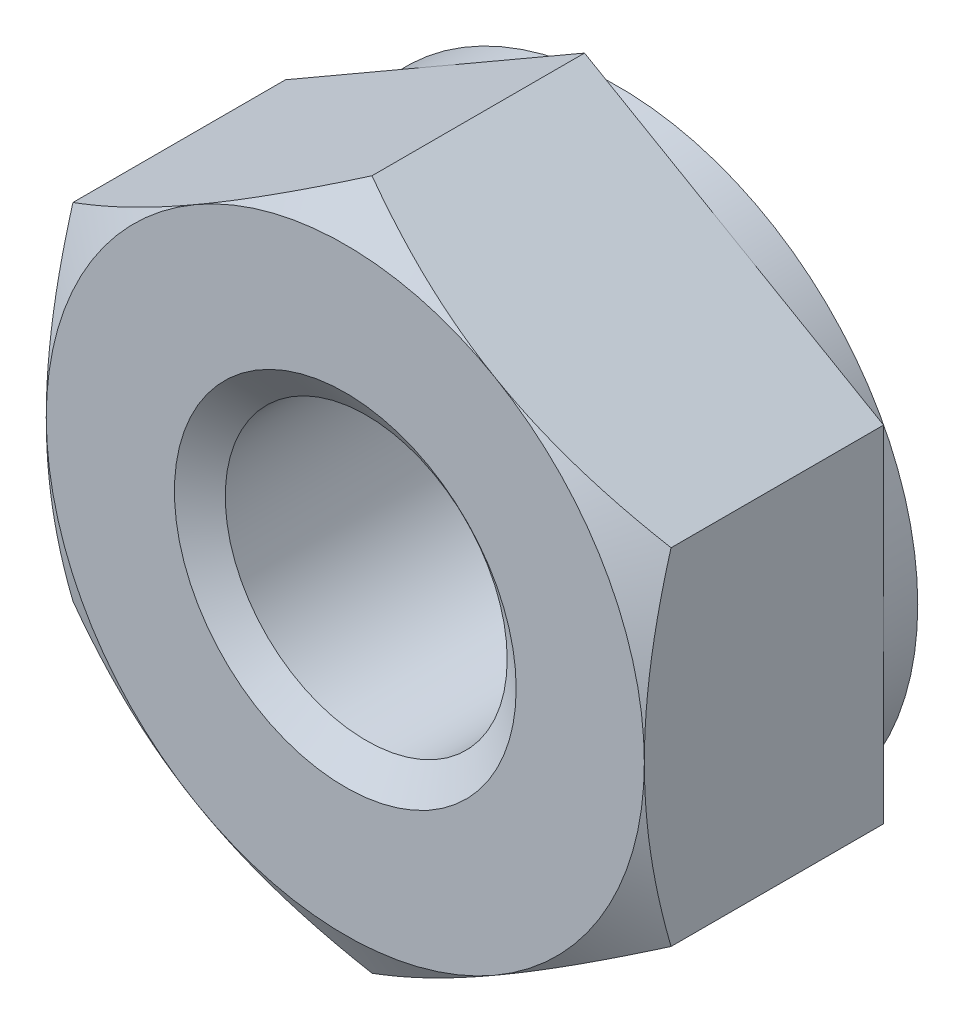
ISO-10303-21;
HEADER;
FILE_DESCRIPTION(('STEP AP214'),'2;1');
FILE_NAME('part.step','',(''),(''),'','','');
FILE_SCHEMA(('AUTOMOTIVE_DESIGN { 1 0 10303 214 1 1 1 1 }'));
ENDSEC;
DATA;
#1=APPLICATION_CONTEXT('core data for automotive mechanical design processes');
#2=APPLICATION_PROTOCOL_DEFINITION('international standard','automotive_design',2000,#1);
#3=PRODUCT_CONTEXT('',#1,'mechanical');
#4=PRODUCT('Part','Part','',(#3));
#5=PRODUCT_RELATED_PRODUCT_CATEGORY('part','',(#4));
#6=PRODUCT_DEFINITION_FORMATION('','',#4);
#7=PRODUCT_DEFINITION_CONTEXT('part definition',#1,'design');
#8=PRODUCT_DEFINITION('design','',#6,#7);
#9=PRODUCT_DEFINITION_SHAPE('','',#8);
#10=(LENGTH_UNIT() NAMED_UNIT(*) SI_UNIT(.MILLI.,.METRE.));
#11=(NAMED_UNIT(*) PLANE_ANGLE_UNIT() SI_UNIT($,.RADIAN.));
#12=(NAMED_UNIT(*) SI_UNIT($,.STERADIAN.) SOLID_ANGLE_UNIT());
#13=UNCERTAINTY_MEASURE_WITH_UNIT(LENGTH_MEASURE(1.E-05),#10,'distance_accuracy_value','');
#14=(GEOMETRIC_REPRESENTATION_CONTEXT(3) GLOBAL_UNCERTAINTY_ASSIGNED_CONTEXT((#13)) GLOBAL_UNIT_ASSIGNED_CONTEXT((#10,
#11,#12)) REPRESENTATION_CONTEXT('',''));
#15=CARTESIAN_POINT('',(0.,0.,0.));
#16=DIRECTION('',(0.,0.,1.));
#17=DIRECTION('',(1.,0.,0.));
#18=AXIS2_PLACEMENT_3D('',#15,#16,#17);
#19=CARTESIAN_POINT('',(0.,0.,-3.2));
#20=DIRECTION('',(0.,0.,1.));
#21=DIRECTION('',(1.,0.,0.));
#22=AXIS2_PLACEMENT_3D('',#19,#20,#21);
#23=CYLINDRICAL_SURFACE('',#22,1.65);
#24=CARTESIAN_POINT('',(0.,0.,-0.245072638373399));
#25=DIRECTION('',(0.,0.,1.));
#26=DIRECTION('',(1.,0.,0.));
#27=AXIS2_PLACEMENT_3D('',#24,#25,#26);
#28=CIRCLE('',#27,1.65);
#29=CARTESIAN_POINT('',(1.65,0.,-0.245072638373399));
#30=VERTEX_POINT('',#29);
#31=EDGE_CURVE('E151',#30,#30,#28,.F.);
#32=ORIENTED_EDGE('',*,*,#31,.F.);
#33=EDGE_LOOP('',(#32));
#34=FACE_BOUND('',#33,.T.);
#35=CARTESIAN_POINT('',(0.,0.,-2.9295273616266));
#36=DIRECTION('',(0.,0.,-1.));
#37=DIRECTION('',(-1.,0.,0.));
#38=AXIS2_PLACEMENT_3D('',#35,#36,#37);
#39=CIRCLE('',#38,1.65);
#40=CARTESIAN_POINT('',(-1.65,0.,-2.9295273616266));
#41=VERTEX_POINT('',#40);
#42=EDGE_CURVE('E39',#41,#41,#39,.F.);
#43=ORIENTED_EDGE('',*,*,#42,.F.);
#44=EDGE_LOOP('',(#43));
#45=FACE_BOUND('',#44,.T.);
#46=ADVANCED_FACE('F34',(#34,#45),#23,.F.);
#47=CARTESIAN_POINT('',(0.,4.04145188432738,-3.2));
#48=DIRECTION('',(-0.500000000000001,0.866025403784438,0.));
#49=DIRECTION('',(-0.866025403784438,-0.500000000000001,0.));
#50=AXIS2_PLACEMENT_3D('',#47,#48,#49);
#51=PLANE('',#50);
#52=DIRECTION('',(0.,0.,1.));
#53=VECTOR('',#52,1.);
#54=CARTESIAN_POINT('',(-3.5,2.02072594216369,-3.2));
#55=LINE('',#54,#53);
#56=CARTESIAN_POINT('',(-3.5,2.02072594216369,-2.8));
#57=VERTEX_POINT('',#56);
#58=CARTESIAN_POINT('',(-3.5,2.02072594216369,-0.312607391169645));
#59=VERTEX_POINT('',#58);
#60=EDGE_CURVE('E292',#57,#59,#55,.T.);
#61=ORIENTED_EDGE('',*,*,#60,.T.);
#62=CARTESIAN_POINT('',(-3.5002,2.02061047210985,-0.312674060693371));
#63=CARTESIAN_POINT('',(-3.34639282154755,2.10941108799267,-0.261385788989983));
#64=CARTESIAN_POINT('',(-3.19125798916558,2.19897822522909,-0.214740953816197));
#65=CARTESIAN_POINT('',(-2.87830199342322,2.37966345361545,-0.133321875533348));
#66=CARTESIAN_POINT('',(-2.7204752692125,2.47078475532382,-0.0985764355845607));
#67=CARTESIAN_POINT('',(-2.40677778961987,2.65189807961073,-0.0444900271828352));
#68=CARTESIAN_POINT('',(-2.25095530083931,2.74186223545399,-0.0247890862603806));
#69=CARTESIAN_POINT('',(-1.93857711279463,2.92221386641056,-0.00127013273725369));
#70=CARTESIAN_POINT('',(-1.78202254896577,3.01260068598001,0.0025673554544352));
#71=CARTESIAN_POINT('',(-1.48949078007901,3.1814939814933,-0.00541530187697749));
#72=CARTESIAN_POINT('',(-1.35346978754209,3.26002573814993,-0.015275434069607));
#73=CARTESIAN_POINT('',(-1.08231397971101,3.41657761679354,-0.0465264668994037));
#74=CARTESIAN_POINT('',(-0.947180102315317,3.49459719728458,-0.0679280432857986));
#75=CARTESIAN_POINT('',(-0.675465207594816,3.65147186489429,-0.121430407880578));
#76=CARTESIAN_POINT('',(-0.538918580721664,3.73030709667644,-0.153757994445088));
#77=CARTESIAN_POINT('',(-0.267861907055498,3.88680174018324,-0.227128933807995));
#78=CARTESIAN_POINT('',(-0.133348387531463,3.96446315689009,-0.268155046569868));
#79=CARTESIAN_POINT('',(0.00020000000000009,4.04156735438122,-0.312674060693373));
#80=B_SPLINE_CURVE_WITH_KNOTS('',3,(#62,#63,#64,#65,#66,#67,#68,#69,#70,#71,#72,#73,#74,#75,#76,
#77,#78,#79),.UNSPECIFIED.,.F.,.F.,(4,2,2,2,2,2,2,2,4),(0.,0.554793832886254,1.11092123814984,
1.65328467083219,2.19498204478403,2.6666513085086,3.13875761298267,3.6213361260051,
4.10296698719187),.UNSPECIFIED.);
#81=CARTESIAN_POINT('',(-1.75,3.03108891324553,0.));
#82=VERTEX_POINT('',#81);
#83=EDGE_CURVE('E58',#59,#82,#80,.T.);
#84=ORIENTED_EDGE('',*,*,#83,.T.);
#85=CARTESIAN_POINT('',(0.,4.04145188432738,-0.312607391169645));
#86=VERTEX_POINT('',#85);
#87=EDGE_CURVE('E165',#82,#86,#80,.T.);
#88=ORIENTED_EDGE('',*,*,#87,.T.);
#89=DIRECTION('',(0.,0.,1.));
#90=VECTOR('',#89,1.);
#91=CARTESIAN_POINT('',(0.,4.04145188432738,-3.2));
#92=LINE('',#91,#90);
#93=CARTESIAN_POINT('',(0.,4.04145188432738,-2.8));
#94=VERTEX_POINT('',#93);
#95=EDGE_CURVE('E280',#94,#86,#92,.T.);
#96=ORIENTED_EDGE('',*,*,#95,.F.);
#97=DIRECTION('',(-0.866025403784438,-0.500000000000001,0.));
#98=VECTOR('',#97,1.);
#99=CARTESIAN_POINT('',(0.,4.04145188432738,-2.8));
#100=LINE('',#99,#98);
#101=CARTESIAN_POINT('',(-1.75,3.03108891324553,-2.8));
#102=VERTEX_POINT('',#101);
#103=EDGE_CURVE('E268',#94,#102,#100,.T.);
#104=ORIENTED_EDGE('',*,*,#103,.T.);
#105=EDGE_CURVE('E264',#102,#57,#100,.T.);
#106=ORIENTED_EDGE('',*,*,#105,.T.);
#107=EDGE_LOOP('',(#61,#84,#88,#96,#104,#106));
#108=FACE_BOUND('',#107,.T.);
#109=ADVANCED_FACE('F36',(#108),#51,.T.);
#110=CARTESIAN_POINT('',(3.5,2.02072594216369,-3.2));
#111=DIRECTION('',(0.500000000000001,0.866025403784438,0.));
#112=DIRECTION('',(-0.866025403784438,0.500000000000001,0.));
#113=AXIS2_PLACEMENT_3D('',#110,#111,#112);
#114=PLANE('',#113);
#115=ORIENTED_EDGE('',*,*,#95,.T.);
#116=CARTESIAN_POINT('',(-0.000200000000000017,4.04156735438122,-0.312674060693373));
#117=CARTESIAN_POINT('',(0.15360717845245,3.9527667384984,-0.261385788989985));
#118=CARTESIAN_POINT('',(0.308742010834424,3.86319960126198,-0.214740953816198));
#119=CARTESIAN_POINT('',(0.621698006576781,3.68251437287562,-0.133321875533349));
#120=CARTESIAN_POINT('',(0.779524730787496,3.59139307116725,-0.0985764355845619));
#121=CARTESIAN_POINT('',(1.09322221038013,3.41027974688034,-0.0444900271828362));
#122=CARTESIAN_POINT('',(1.24904469916069,3.32031559103708,-0.0247890862603814));
#123=CARTESIAN_POINT('',(1.56142288720537,3.13996396008052,-0.00127013273725391));
#124=CARTESIAN_POINT('',(1.71797745103423,3.04957714051106,0.00256735545443529));
#125=CARTESIAN_POINT('',(2.01050921992099,2.88068384499777,-0.0054153018769771));
#126=CARTESIAN_POINT('',(2.14653021245791,2.80215208834114,-0.0152754340696066));
#127=CARTESIAN_POINT('',(2.417686020289,2.64560020969753,-0.0465264668994031));
#128=CARTESIAN_POINT('',(2.55281989768468,2.56758062920649,-0.0679280432857978));
#129=CARTESIAN_POINT('',(2.82453479240518,2.41070596159678,-0.121430407880577));
#130=CARTESIAN_POINT('',(2.96108141927834,2.33187072981463,-0.153757994445087));
#131=CARTESIAN_POINT('',(3.2321380929445,2.17537608630783,-0.227128933807994));
#132=CARTESIAN_POINT('',(3.36665161246854,2.09771466960098,-0.268155046569867));
#133=CARTESIAN_POINT('',(3.5002,2.02061047210985,-0.312674060693371));
#134=B_SPLINE_CURVE_WITH_KNOTS('',3,(#116,#117,#118,#119,#120,#121,#122,#123,#124,#125,#126,
#127,#128,#129,#130,#131,#132,#133),.UNSPECIFIED.,.F.,.F.,(4,2,2,2,2,2,2,2,4),(0.,
0.554793832886254,1.11092123814984,1.65328467083219,2.19498204478403,2.6666513085086,
3.13875761298268,3.6213361260051,4.10296698719188),.UNSPECIFIED.);
#135=CARTESIAN_POINT('',(1.75,3.03108891324553,0.));
#136=VERTEX_POINT('',#135);
#137=EDGE_CURVE('E162',#86,#136,#134,.T.);
#138=ORIENTED_EDGE('',*,*,#137,.T.);
#139=CARTESIAN_POINT('',(3.5,2.02072594216369,-0.312607391169645));
#140=VERTEX_POINT('',#139);
#141=EDGE_CURVE('E145',#136,#140,#134,.T.);
#142=ORIENTED_EDGE('',*,*,#141,.T.);
#143=DIRECTION('',(0.,0.,1.));
#144=VECTOR('',#143,1.);
#145=CARTESIAN_POINT('',(3.5,2.02072594216369,-3.2));
#146=LINE('',#145,#144);
#147=CARTESIAN_POINT('',(3.5,2.02072594216369,-2.8));
#148=VERTEX_POINT('',#147);
#149=EDGE_CURVE('E161',#148,#140,#146,.T.);
#150=ORIENTED_EDGE('',*,*,#149,.F.);
#151=DIRECTION('',(-0.866025403784438,0.500000000000001,0.));
#152=VECTOR('',#151,1.);
#153=CARTESIAN_POINT('',(3.5,2.02072594216369,-2.8));
#154=LINE('',#153,#152);
#155=CARTESIAN_POINT('',(1.75,3.03108891324553,-2.8));
#156=VERTEX_POINT('',#155);
#157=EDGE_CURVE('E276',#148,#156,#154,.T.);
#158=ORIENTED_EDGE('',*,*,#157,.T.);
#159=EDGE_CURVE('E272',#156,#94,#154,.T.);
#160=ORIENTED_EDGE('',*,*,#159,.T.);
#161=EDGE_LOOP('',(#115,#138,#142,#150,#158,#160));
#162=FACE_BOUND('',#161,.T.);
#163=ADVANCED_FACE('F239',(#162),#114,.T.);
#164=CARTESIAN_POINT('',(3.5,2.02072594216369,-3.2));
#165=DIRECTION('',(-1.,0.,0.));
#166=DIRECTION('',(0.,0.,1.));
#167=AXIS2_PLACEMENT_3D('',#164,#165,#166);
#168=PLANE('',#167);
#169=CARTESIAN_POINT('',(3.5,-5.35926299121406,-1.67484346858556));
#170=CARTESIAN_POINT('',(3.5,-5.20559319908842,-1.60058173692104));
#171=CARTESIAN_POINT('',(3.5,-5.05156008083375,-1.52705822833147));
#172=CARTESIAN_POINT('',(3.5,-4.7425707418071,-1.38190950344752));
#173=CARTESIAN_POINT('',(3.5,-4.58761436682437,-1.31028461582133));
#174=CARTESIAN_POINT('',(3.5,-4.27574500225542,-1.16897765517624));
#175=CARTESIAN_POINT('',(3.5,-4.11882589028192,-1.09930904568016));
#176=CARTESIAN_POINT('',(3.5,-3.80369792903855,-0.96296426224276));
#177=CARTESIAN_POINT('',(3.5,-3.64548914750595,-0.896287932319518));
#178=CARTESIAN_POINT('',(3.5,-3.32556618401855,-0.765931819095067));
#179=CARTESIAN_POINT('',(3.5,-3.16383281219924,-0.702298873688865));
#180=CARTESIAN_POINT('',(3.5,-2.83845840945597,-0.580016702089493));
#181=CARTESIAN_POINT('',(3.5,-2.67481716858826,-0.521368030370692));
#182=CARTESIAN_POINT('',(3.5,-2.34570278472049,-0.410630279877022));
#183=CARTESIAN_POINT('',(3.5,-2.18023438248742,-0.358527255435858));
#184=CARTESIAN_POINT('',(3.5,-1.8469452280637,-0.262572936976443));
#185=CARTESIAN_POINT('',(3.5,-1.6791252378753,-0.218719033467158));
#186=CARTESIAN_POINT('',(3.5,-1.34101828610925,-0.141391945584787));
#187=CARTESIAN_POINT('',(3.5,-1.17073068027694,-0.107921525211973));
#188=CARTESIAN_POINT('',(3.5,-0.828102385138485,-0.0536149564320503));
#189=CARTESIAN_POINT('',(3.5,-0.655761694017303,-0.0327788191952364));
#190=CARTESIAN_POINT('',(3.5,-0.311020490924451,-0.00558408650575663));
#191=CARTESIAN_POINT('',(3.5,-0.138627397207261,0.000866163165911249));
#192=CARTESIAN_POINT('',(3.5,0.206038074906534,-0.00105355807794609));
#193=CARTESIAN_POINT('',(3.5,0.378310473023179,-0.00941968196343176));
#194=CARTESIAN_POINT('',(3.5,0.672490555822327,-0.0357688927868918));
#195=CARTESIAN_POINT('',(3.5,0.794722791084092,-0.0503206340384211));
#196=CARTESIAN_POINT('',(3.5,1.0382430543056,-0.0859367340533556));
#197=CARTESIAN_POINT('',(3.5,1.15953093025887,-0.107002119926141));
#198=CARTESIAN_POINT('',(3.5,1.52187914771348,-0.178863187081453));
#199=CARTESIAN_POINT('',(3.5,1.76124104212632,-0.23830527562201));
#200=CARTESIAN_POINT('',(3.5,2.11940971387709,-0.340826814402554));
#201=CARTESIAN_POINT('',(3.5,2.24008344316347,-0.377749699085183));
#202=CARTESIAN_POINT('',(3.5,2.48017139213729,-0.455249007699294));
#203=CARTESIAN_POINT('',(3.5,2.59958641795613,-0.49582291166355));
#204=CARTESIAN_POINT('',(3.5,2.83665760451799,-0.579779986782753));
#205=CARTESIAN_POINT('',(3.5,2.95431988203484,-0.623146060034315));
#206=CARTESIAN_POINT('',(3.5,3.188731535088,-0.712423559566866));
#207=CARTESIAN_POINT('',(3.5,3.30548051959464,-0.75833601459295));
#208=CARTESIAN_POINT('',(3.5,3.42180736613349,-0.805270380724071));
#209=B_SPLINE_CURVE_WITH_KNOTS('',3,(#169,#170,#171,#172,#173,#174,#175,#176,#177,#178,#179,
#180,#181,#182,#183,#184,#185,#186,#187,#188,#189,#190,#191,#192,#193,#194,#195,#196,#197,#198,
#199,#200,#201,#202,#203,#204,#205,#206,#207,#208),.UNSPECIFIED.,.F.,.F.,(4,2,2,2,2,2,2,2,2,2,2,
2,2,2,2,2,2,2,2,4),(0.,0.512025318465737,1.02413870177436,1.53918270315241,2.05419982499223,
2.57553975872798,3.09693761309353,3.617205066104,4.13730766217537,4.65754858684364,
5.17778997146961,5.69470725122282,6.21149033452401,6.58059623222331,6.94976036239485,
7.68863804939851,8.06719621660478,8.44549507476761,8.82166461280099,9.1979872473341),.UNSPECIFIED.);
#210=CARTESIAN_POINT('',(3.5,-2.0207259421637,-0.312607391169645));
#211=VERTEX_POINT('',#210);
#212=CARTESIAN_POINT('',(3.5,0.,0.));
#213=VERTEX_POINT('',#212);
#214=EDGE_CURVE('E126',#211,#213,#209,.T.);
#215=ORIENTED_EDGE('',*,*,#214,.F.);
#216=DIRECTION('',(0.,0.,1.));
#217=VECTOR('',#216,1.);
#218=CARTESIAN_POINT('',(3.5,-2.02072594216369,-3.2));
#219=LINE('',#218,#217);
#220=CARTESIAN_POINT('',(3.5,-2.02072594216369,-2.8));
#221=VERTEX_POINT('',#220);
#222=EDGE_CURVE('E285',#221,#211,#219,.T.);
#223=ORIENTED_EDGE('',*,*,#222,.F.);
#224=DIRECTION('',(0.,-1.,0.));
#225=VECTOR('',#224,1.);
#226=CARTESIAN_POINT('',(3.5,2.02072594216369,-2.8));
#227=LINE('',#226,#225);
#228=CARTESIAN_POINT('',(3.5,0.,-2.8));
#229=VERTEX_POINT('',#228);
#230=EDGE_CURVE('E277',#229,#221,#227,.T.);
#231=ORIENTED_EDGE('',*,*,#230,.F.);
#232=EDGE_CURVE('E279',#148,#229,#227,.T.);
#233=ORIENTED_EDGE('',*,*,#232,.F.);
#234=ORIENTED_EDGE('',*,*,#149,.T.);
#235=EDGE_CURVE('E139',#213,#140,#209,.T.);
#236=ORIENTED_EDGE('',*,*,#235,.F.);
#237=EDGE_LOOP('',(#215,#223,#231,#233,#234,#236));
#238=FACE_BOUND('',#237,.T.);
#239=ADVANCED_FACE('F158',(#238),#168,.F.);
#240=CARTESIAN_POINT('',(0.,-4.04145188432739,-3.2));
#241=DIRECTION('',(0.500000000000001,-0.866025403784438,0.));
#242=DIRECTION('',(0.866025403784438,0.500000000000001,0.));
#243=AXIS2_PLACEMENT_3D('',#240,#241,#242);
#244=PLANE('',#243);
#245=ORIENTED_EDGE('',*,*,#222,.T.);
#246=CARTESIAN_POINT('',(3.5002,-2.02061047210986,-0.312674060693373));
#247=CARTESIAN_POINT('',(3.34639282154755,-2.10941108799268,-0.261385788989985));
#248=CARTESIAN_POINT('',(3.19125798916558,-2.1989782252291,-0.214740953816199));
#249=CARTESIAN_POINT('',(2.87830199342322,-2.37966345361545,-0.13332187553335));
#250=CARTESIAN_POINT('',(2.7204752692125,-2.47078475532383,-0.0985764355845633));
#251=CARTESIAN_POINT('',(2.40677778961987,-2.65189807961074,-0.0444900271828381));
#252=CARTESIAN_POINT('',(2.25095530083931,-2.741862235454,-0.0247890862603835));
#253=CARTESIAN_POINT('',(1.93857711279463,-2.92221386641056,-0.00127013273725658));
#254=CARTESIAN_POINT('',(1.78202254896577,-3.01260068598002,0.0025673554544322));
#255=CARTESIAN_POINT('',(1.48949078007901,-3.1814939814933,-0.00541530187698085));
#256=CARTESIAN_POINT('',(1.35346978754209,-3.26002573814993,-0.0152754340696105));
#257=CARTESIAN_POINT('',(1.082313979711,-3.41657761679354,-0.0465264668994074));
#258=CARTESIAN_POINT('',(0.947180102315316,-3.49459719728458,-0.0679280432858022));
#259=CARTESIAN_POINT('',(0.675465207594816,-3.65147186489429,-0.121430407880581));
#260=CARTESIAN_POINT('',(0.538918580721664,-3.73030709667644,-0.153757994445091));
#261=CARTESIAN_POINT('',(0.267861907055498,-3.88680174018325,-0.227128933807999));
#262=CARTESIAN_POINT('',(0.133348387531463,-3.9644631568901,-0.268155046569872));
#263=CARTESIAN_POINT('',(-0.00019999999999994,-4.04156735438123,-0.312674060693376));
#264=B_SPLINE_CURVE_WITH_KNOTS('',3,(#246,#247,#248,#249,#250,#251,#252,#253,#254,#255,#256,
#257,#258,#259,#260,#261,#262,#263),.UNSPECIFIED.,.F.,.F.,(4,2,2,2,2,2,2,2,4),(0.,
0.554793832886254,1.11092123814984,1.65328467083219,2.19498204478403,2.6666513085086,
3.13875761298267,3.6213361260051,4.10296698719187),.UNSPECIFIED.);
#265=CARTESIAN_POINT('',(1.75,-3.03108891324553,0.));
#266=VERTEX_POINT('',#265);
#267=EDGE_CURVE('E133',#211,#266,#264,.T.);
#268=ORIENTED_EDGE('',*,*,#267,.T.);
#269=CARTESIAN_POINT('',(0.,-4.04145188432738,-0.312607391169645));
#270=VERTEX_POINT('',#269);
#271=EDGE_CURVE('E173',#266,#270,#264,.T.);
#272=ORIENTED_EDGE('',*,*,#271,.T.);
#273=DIRECTION('',(0.,0.,1.));
#274=VECTOR('',#273,1.);
#275=CARTESIAN_POINT('',(0.,-4.04145188432739,-3.2));
#276=LINE('',#275,#274);
#277=CARTESIAN_POINT('',(0.,-4.04145188432739,-2.8));
#278=VERTEX_POINT('',#277);
#279=EDGE_CURVE('E287',#278,#270,#276,.T.);
#280=ORIENTED_EDGE('',*,*,#279,.F.);
#281=DIRECTION('',(0.866025403784438,0.500000000000001,0.));
#282=VECTOR('',#281,1.);
#283=CARTESIAN_POINT('',(0.,-4.04145188432739,-2.8));
#284=LINE('',#283,#282);
#285=CARTESIAN_POINT('',(1.75000000000001,-3.03108891324554,-2.8));
#286=VERTEX_POINT('',#285);
#287=EDGE_CURVE('E269',#278,#286,#284,.T.);
#288=ORIENTED_EDGE('',*,*,#287,.T.);
#289=EDGE_CURVE('E273',#286,#221,#284,.T.);
#290=ORIENTED_EDGE('',*,*,#289,.T.);
#291=EDGE_LOOP('',(#245,#268,#272,#280,#288,#290));
#292=FACE_BOUND('',#291,.T.);
#293=ADVANCED_FACE('F220',(#292),#244,.T.);
#294=CARTESIAN_POINT('',(-3.5,-2.02072594216369,-3.2));
#295=DIRECTION('',(-0.500000000000001,-0.866025403784438,0.));
#296=DIRECTION('',(0.866025403784438,-0.500000000000001,0.));
#297=AXIS2_PLACEMENT_3D('',#294,#295,#296);
#298=PLANE('',#297);
#299=ORIENTED_EDGE('',*,*,#279,.T.);
#300=CARTESIAN_POINT('',(0.000200000000000125,-4.04156735438123,-0.312674060693376));
#301=CARTESIAN_POINT('',(-0.15360717845245,-3.95276673849841,-0.261385788989988));
#302=CARTESIAN_POINT('',(-0.308742010834424,-3.86319960126199,-0.214740953816202));
#303=CARTESIAN_POINT('',(-0.621698006576782,-3.68251437287563,-0.133321875533353));
#304=CARTESIAN_POINT('',(-0.779524730787497,-3.59139307116726,-0.0985764355845651));
#305=CARTESIAN_POINT('',(-1.09322221038013,-3.41027974688034,-0.0444900271828393));
#306=CARTESIAN_POINT('',(-1.24904469916069,-3.32031559103708,-0.0247890862603846));
#307=CARTESIAN_POINT('',(-1.56142288720538,-3.13996396008052,-0.00127013273725701));
#308=CARTESIAN_POINT('',(-1.71797745103423,-3.04957714051106,0.00256735545443234));
#309=CARTESIAN_POINT('',(-2.01050921992099,-2.88068384499778,-0.00541530187698013));
#310=CARTESIAN_POINT('',(-2.14653021245791,-2.80215208834115,-0.0152754340696097));
#311=CARTESIAN_POINT('',(-2.417686020289,-2.64560020969754,-0.0465264668994061));
#312=CARTESIAN_POINT('',(-2.55281989768468,-2.5675806292065,-0.0679280432858006));
#313=CARTESIAN_POINT('',(-2.82453479240518,-2.41070596159679,-0.121430407880579));
#314=CARTESIAN_POINT('',(-2.96108141927834,-2.33187072981464,-0.153757994445089));
#315=CARTESIAN_POINT('',(-3.2321380929445,-2.17537608630783,-0.227128933807996));
#316=CARTESIAN_POINT('',(-3.36665161246854,-2.09771466960099,-0.268155046569869));
#317=CARTESIAN_POINT('',(-3.5002,-2.02061047210986,-0.312674060693373));
#318=B_SPLINE_CURVE_WITH_KNOTS('',3,(#300,#301,#302,#303,#304,#305,#306,#307,#308,#309,#310,
#311,#312,#313,#314,#315,#316,#317),.UNSPECIFIED.,.F.,.F.,(4,2,2,2,2,2,2,2,4),(0.,
0.554793832886255,1.11092123814984,1.65328467083219,2.19498204478404,2.6666513085086,
3.13875761298268,3.6213361260051,4.10296698719187),.UNSPECIFIED.);
#319=CARTESIAN_POINT('',(-1.75,-3.03108891324553,0.));
#320=VERTEX_POINT('',#319);
#321=EDGE_CURVE('E214',#270,#320,#318,.T.);
#322=ORIENTED_EDGE('',*,*,#321,.T.);
#323=CARTESIAN_POINT('',(-3.5,-2.02072594216369,-0.312607391169645));
#324=VERTEX_POINT('',#323);
#325=EDGE_CURVE('E206',#320,#324,#318,.T.);
#326=ORIENTED_EDGE('',*,*,#325,.T.);
#327=DIRECTION('',(0.,0.,1.));
#328=VECTOR('',#327,1.);
#329=CARTESIAN_POINT('',(-3.5,-2.02072594216369,-3.2));
#330=LINE('',#329,#328);
#331=CARTESIAN_POINT('',(-3.5,-2.02072594216369,-2.8));
#332=VERTEX_POINT('',#331);
#333=EDGE_CURVE('E290',#332,#324,#330,.T.);
#334=ORIENTED_EDGE('',*,*,#333,.F.);
#335=DIRECTION('',(0.866025403784438,-0.500000000000001,0.));
#336=VECTOR('',#335,1.);
#337=CARTESIAN_POINT('',(-3.5,-2.02072594216369,-2.8));
#338=LINE('',#337,#336);
#339=CARTESIAN_POINT('',(-1.75000000000001,-3.03108891324554,-2.8));
#340=VERTEX_POINT('',#339);
#341=EDGE_CURVE('E259',#332,#340,#338,.T.);
#342=ORIENTED_EDGE('',*,*,#341,.T.);
#343=EDGE_CURVE('E265',#340,#278,#338,.T.);
#344=ORIENTED_EDGE('',*,*,#343,.T.);
#345=EDGE_LOOP('',(#299,#322,#326,#334,#342,#344));
#346=FACE_BOUND('',#345,.T.);
#347=ADVANCED_FACE('F216',(#346),#298,.T.);
#348=CARTESIAN_POINT('',(-3.5,2.02072594216369,-3.2));
#349=DIRECTION('',(-1.,0.,0.));
#350=DIRECTION('',(0.,0.,1.));
#351=AXIS2_PLACEMENT_3D('',#348,#349,#350);
#352=PLANE('',#351);
#353=ORIENTED_EDGE('',*,*,#333,.T.);
#354=CARTESIAN_POINT('',(-3.5,-5.35926299121406,-1.67484346858556));
#355=CARTESIAN_POINT('',(-3.5,-5.20559319908842,-1.60058173692104));
#356=CARTESIAN_POINT('',(-3.5,-5.05156008083375,-1.52705822833147));
#357=CARTESIAN_POINT('',(-3.5,-4.7425707418071,-1.38190950344752));
#358=CARTESIAN_POINT('',(-3.5,-4.58761436682437,-1.31028461582133));
#359=CARTESIAN_POINT('',(-3.5,-4.27574500225542,-1.16897765517624));
#360=CARTESIAN_POINT('',(-3.5,-4.11882589028192,-1.09930904568016));
#361=CARTESIAN_POINT('',(-3.5,-3.80369792903855,-0.962964262242761));
#362=CARTESIAN_POINT('',(-3.5,-3.64548914750595,-0.896287932319519));
#363=CARTESIAN_POINT('',(-3.5,-3.32556618401855,-0.765931819095067));
#364=CARTESIAN_POINT('',(-3.5,-3.16383281219924,-0.702298873688865));
#365=CARTESIAN_POINT('',(-3.5,-2.83845840945597,-0.580016702089493));
#366=CARTESIAN_POINT('',(-3.5,-2.67481716858826,-0.521368030370692));
#367=CARTESIAN_POINT('',(-3.5,-2.34570278472049,-0.410630279877022));
#368=CARTESIAN_POINT('',(-3.5,-2.18023438248743,-0.358527255435858));
#369=CARTESIAN_POINT('',(-3.5,-1.8469452280637,-0.262572936976443));
#370=CARTESIAN_POINT('',(-3.5,-1.6791252378753,-0.218719033467158));
#371=CARTESIAN_POINT('',(-3.5,-1.34101828610925,-0.141391945584787));
#372=CARTESIAN_POINT('',(-3.5,-1.17073068027694,-0.107921525211973));
#373=CARTESIAN_POINT('',(-3.5,-0.828102385138485,-0.0536149564320503));
#374=CARTESIAN_POINT('',(-3.5,-0.655761694017303,-0.0327788191952365));
#375=CARTESIAN_POINT('',(-3.5,-0.311020490924451,-0.00558408650575659));
#376=CARTESIAN_POINT('',(-3.5,-0.138627397207261,0.000866163165911499));
#377=CARTESIAN_POINT('',(-3.5,0.206038074906534,-0.00105355807794584));
#378=CARTESIAN_POINT('',(-3.5,0.378310473023178,-0.00941968196343173));
#379=CARTESIAN_POINT('',(-3.5,0.672490555822326,-0.0357688927868918));
#380=CARTESIAN_POINT('',(-3.5,0.794722791084091,-0.0503206340384209));
#381=CARTESIAN_POINT('',(-3.5,1.0382430543056,-0.0859367340533552));
#382=CARTESIAN_POINT('',(-3.5,1.15953093025886,-0.107002119926141));
#383=CARTESIAN_POINT('',(-3.5,1.52187914771348,-0.178863187081452));
#384=CARTESIAN_POINT('',(-3.5,1.76124104212632,-0.23830527562201));
#385=CARTESIAN_POINT('',(-3.5,2.11940971387708,-0.340826814402553));
#386=CARTESIAN_POINT('',(-3.5,2.24008344316346,-0.377749699085182));
#387=CARTESIAN_POINT('',(-3.5,2.48017139213728,-0.455249007699292));
#388=CARTESIAN_POINT('',(-3.5,2.59958641795613,-0.495822911663549));
#389=CARTESIAN_POINT('',(-3.5,2.83665760451798,-0.579779986782752));
#390=CARTESIAN_POINT('',(-3.5,2.95431988203483,-0.623146060034314));
#391=CARTESIAN_POINT('',(-3.5,3.188731535088,-0.712423559566866));
#392=CARTESIAN_POINT('',(-3.5,3.30548051959464,-0.758336014592949));
#393=CARTESIAN_POINT('',(-3.5,3.42180736613349,-0.80527038072407));
#394=B_SPLINE_CURVE_WITH_KNOTS('',3,(#354,#355,#356,#357,#358,#359,#360,#361,#362,#363,#364,
#365,#366,#367,#368,#369,#370,#371,#372,#373,#374,#375,#376,#377,#378,#379,#380,#381,#382,#383,
#384,#385,#386,#387,#388,#389,#390,#391,#392,#393),.UNSPECIFIED.,.F.,.F.,(4,2,2,2,2,2,2,2,2,2,2,
2,2,2,2,2,2,2,2,4),(0.,0.512025318465736,1.02413870177436,1.53918270315241,2.05419982499223,
2.57553975872798,3.09693761309353,3.617205066104,4.13730766217537,4.65754858684364,
5.17778997146961,5.69470725122282,6.211490334524,6.58059623222331,6.94976036239485,
7.68863804939851,8.06719621660478,8.4454950747676,8.82166461280099,9.1979872473341),.UNSPECIFIED.);
#395=CARTESIAN_POINT('',(-3.5,0.,0.));
#396=VERTEX_POINT('',#395);
#397=EDGE_CURVE('E215',#324,#396,#394,.T.);
#398=ORIENTED_EDGE('',*,*,#397,.T.);
#399=EDGE_CURVE('E150',#396,#59,#394,.T.);
#400=ORIENTED_EDGE('',*,*,#399,.T.);
#401=ORIENTED_EDGE('',*,*,#60,.F.);
#402=DIRECTION('',(0.,-1.,0.));
#403=VECTOR('',#402,1.);
#404=CARTESIAN_POINT('',(-3.5,2.02072594216369,-2.8));
#405=LINE('',#404,#403);
#406=CARTESIAN_POINT('',(-3.5,0.,-2.8));
#407=VERTEX_POINT('',#406);
#408=EDGE_CURVE('E299',#57,#407,#405,.T.);
#409=ORIENTED_EDGE('',*,*,#408,.T.);
#410=EDGE_CURVE('E297',#407,#332,#405,.T.);
#411=ORIENTED_EDGE('',*,*,#410,.T.);
#412=EDGE_LOOP('',(#353,#398,#400,#401,#409,#411));
#413=FACE_BOUND('',#412,.T.);
#414=ADVANCED_FACE('F219',(#413),#352,.T.);
#415=CARTESIAN_POINT('',(0.,4.04145188432738,0.));
#416=DIRECTION('',(0.,0.,-1.));
#417=DIRECTION('',(-1.,0.,0.));
#418=AXIS2_PLACEMENT_3D('',#415,#416,#417);
#419=PLANE('',#418);
#420=CARTESIAN_POINT('',(0.,0.,0.));
#421=DIRECTION('',(0.,0.,1.));
#422=DIRECTION('',(1.,0.,0.));
#423=AXIS2_PLACEMENT_3D('',#420,#421,#422);
#424=CIRCLE('',#423,2.);
#425=CARTESIAN_POINT('',(2.,0.,0.));
#426=VERTEX_POINT('',#425);
#427=EDGE_CURVE('E302',#426,#426,#424,.T.);
#428=ORIENTED_EDGE('',*,*,#427,.F.);
#429=EDGE_LOOP('',(#428));
#430=FACE_BOUND('',#429,.T.);
#431=CARTESIAN_POINT('',(0.,0.,0.));
#432=DIRECTION('',(0.,0.,-1.));
#433=DIRECTION('',(-1.,0.,0.));
#434=AXIS2_PLACEMENT_3D('',#431,#432,#433);
#435=CIRCLE('',#434,3.5);
#436=EDGE_CURVE('E46',#82,#396,#435,.F.);
#437=ORIENTED_EDGE('',*,*,#436,.T.);
#438=EDGE_CURVE('E12',#396,#320,#435,.F.);
#439=ORIENTED_EDGE('',*,*,#438,.T.);
#440=EDGE_CURVE('E44',#320,#266,#435,.F.);
#441=ORIENTED_EDGE('',*,*,#440,.T.);
#442=EDGE_CURVE('E130',#266,#213,#435,.F.);
#443=ORIENTED_EDGE('',*,*,#442,.T.);
#444=CARTESIAN_POINT('',(0.,0.,0.));
#445=DIRECTION('',(0.,0.,1.));
#446=DIRECTION('',(1.,0.,0.));
#447=AXIS2_PLACEMENT_3D('',#444,#445,#446);
#448=CIRCLE('',#447,3.5);
#449=EDGE_CURVE('E142',#213,#136,#448,.T.);
#450=ORIENTED_EDGE('',*,*,#449,.T.);
#451=EDGE_CURVE('E156',#136,#82,#435,.F.);
#452=ORIENTED_EDGE('',*,*,#451,.T.);
#453=EDGE_LOOP('',(#437,#439,#441,#443,#450,#452));
#454=FACE_BOUND('',#453,.T.);
#455=ADVANCED_FACE('F154',(#430,#454),#419,.F.);
#456=CARTESIAN_POINT('',(0.,4.04145188432738,-3.2));
#457=DIRECTION('',(0.,0.,-1.));
#458=DIRECTION('',(-1.,0.,0.));
#459=AXIS2_PLACEMENT_3D('',#456,#457,#458);
#460=PLANE('',#459);
#461=CARTESIAN_POINT('',(0.,0.,-3.2));
#462=DIRECTION('',(0.,0.,-1.));
#463=DIRECTION('',(-1.,0.,0.));
#464=AXIS2_PLACEMENT_3D('',#461,#462,#463);
#465=CIRCLE('',#464,2.);
#466=CARTESIAN_POINT('',(-2.,0.,-3.2));
#467=VERTEX_POINT('',#466);
#468=EDGE_CURVE('E303',#467,#467,#465,.F.);
#469=ORIENTED_EDGE('',*,*,#468,.T.);
#470=EDGE_LOOP('',(#469));
#471=FACE_BOUND('',#470,.T.);
#472=CARTESIAN_POINT('',(0.,0.,-3.2));
#473=DIRECTION('',(0.,0.,-1.));
#474=DIRECTION('',(-1.,0.,0.));
#475=AXIS2_PLACEMENT_3D('',#472,#473,#474);
#476=CIRCLE('',#475,3.5);
#477=CARTESIAN_POINT('',(-3.5,0.,-3.2));
#478=VERTEX_POINT('',#477);
#479=EDGE_CURVE('E283',#478,#478,#476,.F.);
#480=ORIENTED_EDGE('',*,*,#479,.F.);
#481=EDGE_LOOP('',(#480));
#482=FACE_BOUND('',#481,.T.);
#483=ADVANCED_FACE('F229',(#471,#482),#460,.T.);
#484=CARTESIAN_POINT('',(0.,14.0414518843274,-2.8));
#485=DIRECTION('',(0.,0.,-1.));
#486=DIRECTION('',(-1.,0.,0.));
#487=AXIS2_PLACEMENT_3D('',#484,#485,#486);
#488=PLANE('',#487);
#489=ORIENTED_EDGE('',*,*,#232,.T.);
#490=CARTESIAN_POINT('',(0.,0.,-2.8));
#491=DIRECTION('',(0.,0.,1.));
#492=DIRECTION('',(1.,0.,0.));
#493=AXIS2_PLACEMENT_3D('',#490,#491,#492);
#494=CIRCLE('',#493,3.5);
#495=EDGE_CURVE('E256',#229,#156,#494,.T.);
#496=ORIENTED_EDGE('',*,*,#495,.T.);
#497=ORIENTED_EDGE('',*,*,#157,.F.);
#498=EDGE_LOOP('',(#489,#496,#497));
#499=FACE_BOUND('',#498,.T.);
#500=ADVANCED_FACE('F246',(#499),#488,.T.);
#501=ORIENTED_EDGE('',*,*,#230,.T.);
#502=ORIENTED_EDGE('',*,*,#289,.F.);
#503=EDGE_CURVE('E261',#286,#229,#494,.T.);
#504=ORIENTED_EDGE('',*,*,#503,.T.);
#505=EDGE_LOOP('',(#501,#502,#504));
#506=FACE_BOUND('',#505,.T.);
#507=ADVANCED_FACE('F447',(#506),#488,.T.);
#508=EDGE_CURVE('E260',#156,#102,#494,.T.);
#509=ORIENTED_EDGE('',*,*,#508,.T.);
#510=ORIENTED_EDGE('',*,*,#103,.F.);
#511=ORIENTED_EDGE('',*,*,#159,.F.);
#512=EDGE_LOOP('',(#509,#510,#511));
#513=FACE_BOUND('',#512,.T.);
#514=ADVANCED_FACE('F438',(#513),#488,.T.);
#515=ORIENTED_EDGE('',*,*,#343,.F.);
#516=EDGE_CURVE('E511',#340,#286,#494,.T.);
#517=ORIENTED_EDGE('',*,*,#516,.T.);
#518=ORIENTED_EDGE('',*,*,#287,.F.);
#519=EDGE_LOOP('',(#515,#517,#518));
#520=FACE_BOUND('',#519,.T.);
#521=ADVANCED_FACE('F429',(#520),#488,.T.);
#522=EDGE_CURVE('E525',#102,#407,#494,.T.);
#523=ORIENTED_EDGE('',*,*,#522,.T.);
#524=ORIENTED_EDGE('',*,*,#408,.F.);
#525=ORIENTED_EDGE('',*,*,#105,.F.);
#526=EDGE_LOOP('',(#523,#524,#525));
#527=FACE_BOUND('',#526,.T.);
#528=ADVANCED_FACE('F413',(#527),#488,.T.);
#529=CARTESIAN_POINT('',(0.,0.,0.));
#530=DIRECTION('',(0.,0.,1.));
#531=DIRECTION('',(1.,0.,0.));
#532=AXIS2_PLACEMENT_3D('',#529,#530,#531);
#533=CYLINDRICAL_SURFACE('',#532,3.5);
#534=ORIENTED_EDGE('',*,*,#479,.T.);
#535=EDGE_LOOP('',(#534));
#536=FACE_BOUND('',#535,.T.);
#537=ORIENTED_EDGE('',*,*,#508,.F.);
#538=ORIENTED_EDGE('',*,*,#495,.F.);
#539=ORIENTED_EDGE('',*,*,#503,.F.);
#540=ORIENTED_EDGE('',*,*,#516,.F.);
#541=EDGE_CURVE('E527',#407,#340,#494,.T.);
#542=ORIENTED_EDGE('',*,*,#541,.F.);
#543=ORIENTED_EDGE('',*,*,#522,.F.);
#544=EDGE_LOOP('',(#537,#538,#539,#540,#542,#543));
#545=FACE_BOUND('',#544,.T.);
#546=ADVANCED_FACE('F244',(#536,#545),#533,.T.);
#547=ORIENTED_EDGE('',*,*,#410,.F.);
#548=ORIENTED_EDGE('',*,*,#541,.T.);
#549=ORIENTED_EDGE('',*,*,#341,.F.);
#550=EDGE_LOOP('',(#547,#548,#549));
#551=FACE_BOUND('',#550,.T.);
#552=ADVANCED_FACE('F195',(#551),#488,.T.);
#553=CARTESIAN_POINT('',(0.,0.,0.));
#554=DIRECTION('',(0.,0.,-1.));
#555=DIRECTION('',(-1.,0.,0.));
#556=AXIS2_PLACEMENT_3D('',#553,#554,#555);
#557=CONICAL_SURFACE('',#556,3.5,1.0471975511966);
#558=ORIENTED_EDGE('',*,*,#399,.F.);
#559=ORIENTED_EDGE('',*,*,#436,.F.);
#560=ORIENTED_EDGE('',*,*,#83,.F.);
#561=EDGE_LOOP('',(#558,#559,#560));
#562=FACE_BOUND('',#561,.T.);
#563=ADVANCED_FACE('F375',(#562),#557,.T.);
#564=ORIENTED_EDGE('',*,*,#451,.F.);
#565=ORIENTED_EDGE('',*,*,#137,.F.);
#566=ORIENTED_EDGE('',*,*,#87,.F.);
#567=EDGE_LOOP('',(#564,#565,#566));
#568=FACE_BOUND('',#567,.T.);
#569=ADVANCED_FACE('F193',(#568),#557,.T.);
#570=ORIENTED_EDGE('',*,*,#449,.F.);
#571=ORIENTED_EDGE('',*,*,#235,.T.);
#572=ORIENTED_EDGE('',*,*,#141,.F.);
#573=EDGE_LOOP('',(#570,#571,#572));
#574=FACE_BOUND('',#573,.T.);
#575=ADVANCED_FACE('F143',(#574),#557,.T.);
#576=ORIENTED_EDGE('',*,*,#214,.T.);
#577=ORIENTED_EDGE('',*,*,#442,.F.);
#578=ORIENTED_EDGE('',*,*,#267,.F.);
#579=EDGE_LOOP('',(#576,#577,#578));
#580=FACE_BOUND('',#579,.T.);
#581=ADVANCED_FACE('F128',(#580),#557,.T.);
#582=ORIENTED_EDGE('',*,*,#440,.F.);
#583=ORIENTED_EDGE('',*,*,#321,.F.);
#584=ORIENTED_EDGE('',*,*,#271,.F.);
#585=EDGE_LOOP('',(#582,#583,#584));
#586=FACE_BOUND('',#585,.T.);
#587=ADVANCED_FACE('F192',(#586),#557,.T.);
#588=ORIENTED_EDGE('',*,*,#438,.F.);
#589=ORIENTED_EDGE('',*,*,#397,.F.);
#590=ORIENTED_EDGE('',*,*,#325,.F.);
#591=EDGE_LOOP('',(#588,#589,#590));
#592=FACE_BOUND('',#591,.T.);
#593=ADVANCED_FACE('F186',(#592),#557,.T.);
#594=CARTESIAN_POINT('',(0.,0.,-0.269579902210739));
#595=DIRECTION('',(0.,0.,1.));
#596=DIRECTION('',(1.,0.,0.));
#597=AXIS2_PLACEMENT_3D('',#594,#595,#596);
#598=CONICAL_SURFACE('',#597,1.615,0.95993108859688);
#599=ORIENTED_EDGE('',*,*,#427,.T.);
#600=EDGE_LOOP('',(#599));
#601=FACE_BOUND('',#600,.T.);
#602=ORIENTED_EDGE('',*,*,#31,.T.);
#603=EDGE_LOOP('',(#602));
#604=FACE_BOUND('',#603,.T.);
#605=ADVANCED_FACE('F191',(#601,#604),#598,.F.);
#606=CARTESIAN_POINT('',(0.,0.,-3.1746));
#607=DIRECTION('',(0.,0.,-1.));
#608=DIRECTION('',(-1.,0.,0.));
#609=AXIS2_PLACEMENT_3D('',#606,#607,#608);
#610=CONICAL_SURFACE('',#609,2.,0.95993108859688);
#611=CARTESIAN_POINT('',(0.,0.,-3.1746));
#612=DIRECTION('',(0.,0.,1.));
#613=DIRECTION('',(1.,0.,0.));
#614=AXIS2_PLACEMENT_3D('',#611,#612,#613);
#615=CIRCLE('',#614,2.);
#616=CARTESIAN_POINT('',(2.,0.,-3.1746));
#617=VERTEX_POINT('',#616);
#618=EDGE_CURVE('E305',#617,#617,#615,.T.);
#619=ORIENTED_EDGE('',*,*,#618,.F.);
#620=EDGE_LOOP('',(#619));
#621=FACE_BOUND('',#620,.T.);
#622=ORIENTED_EDGE('',*,*,#42,.T.);
#623=EDGE_LOOP('',(#622));
#624=FACE_BOUND('',#623,.T.);
#625=ADVANCED_FACE('F318',(#621,#624),#610,.F.);
#626=CARTESIAN_POINT('',(0.,0.,-25.0375057290932));
#627=DIRECTION('',(0.,0.,1.));
#628=DIRECTION('',(1.,0.,0.));
#629=AXIS2_PLACEMENT_3D('',#626,#627,#628);
#630=CYLINDRICAL_SURFACE('',#629,2.);
#631=ORIENTED_EDGE('',*,*,#468,.F.);
#632=EDGE_LOOP('',(#631));
#633=FACE_BOUND('',#632,.T.);
#634=ORIENTED_EDGE('',*,*,#618,.T.);
#635=EDGE_LOOP('',(#634));
#636=FACE_BOUND('',#635,.T.);
#637=ADVANCED_FACE('F322',(#633,#636),#630,.F.);
#638=CLOSED_SHELL('',(#46,#109,#163,#239,#293,#347,#414,#455,#483,#500,#507,#514,#521,#528,#546,
#552,#563,#569,#575,#581,#587,#593,#605,#625,#637));
#639=MANIFOLD_SOLID_BREP('B2',#638);
#640=ADVANCED_BREP_SHAPE_REPRESENTATION('',(#18,#639),#14);
#641=SHAPE_DEFINITION_REPRESENTATION(#9,#640);
ENDSEC;
END-ISO-10303-21;
